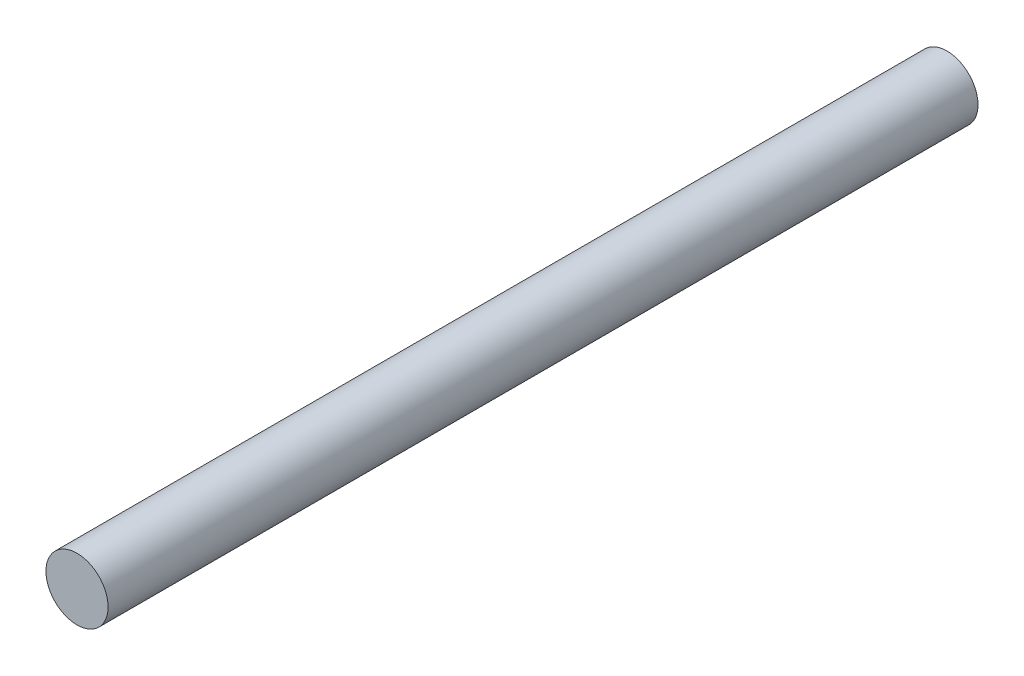
ISO-10303-21;
HEADER;
FILE_DESCRIPTION(('STEP AP214'),'2;1');
FILE_NAME('part.step','',(''),(''),'','','');
FILE_SCHEMA(('AUTOMOTIVE_DESIGN { 1 0 10303 214 1 1 1 1 }'));
ENDSEC;
DATA;
#1=APPLICATION_CONTEXT('core data for automotive mechanical design processes');
#2=APPLICATION_PROTOCOL_DEFINITION('international standard','automotive_design',2000,#1);
#3=PRODUCT_CONTEXT('',#1,'mechanical');
#4=PRODUCT('Part','Part','',(#3));
#5=PRODUCT_RELATED_PRODUCT_CATEGORY('part','',(#4));
#6=PRODUCT_DEFINITION_FORMATION('','',#4);
#7=PRODUCT_DEFINITION_CONTEXT('part definition',#1,'design');
#8=PRODUCT_DEFINITION('design','',#6,#7);
#9=PRODUCT_DEFINITION_SHAPE('','',#8);
#10=(LENGTH_UNIT() NAMED_UNIT(*) SI_UNIT(.MILLI.,.METRE.));
#11=(NAMED_UNIT(*) PLANE_ANGLE_UNIT() SI_UNIT($,.RADIAN.));
#12=(NAMED_UNIT(*) SI_UNIT($,.STERADIAN.) SOLID_ANGLE_UNIT());
#13=UNCERTAINTY_MEASURE_WITH_UNIT(LENGTH_MEASURE(1.E-05),#10,'distance_accuracy_value','');
#14=(GEOMETRIC_REPRESENTATION_CONTEXT(3) GLOBAL_UNCERTAINTY_ASSIGNED_CONTEXT((#13)) GLOBAL_UNIT_ASSIGNED_CONTEXT((#10,
#11,#12)) REPRESENTATION_CONTEXT('',''));
#15=CARTESIAN_POINT('',(0.,0.,0.));
#16=DIRECTION('',(0.,0.,1.));
#17=DIRECTION('',(1.,0.,0.));
#18=AXIS2_PLACEMENT_3D('',#15,#16,#17);
#19=CARTESIAN_POINT('',(0.,0.,70.));
#20=DIRECTION('',(0.,0.,-1.));
#21=DIRECTION('',(-1.,0.,0.));
#22=AXIS2_PLACEMENT_3D('',#19,#20,#21);
#23=CYLINDRICAL_SURFACE('',#22,2.5);
#24=CARTESIAN_POINT('',(0.,0.,70.));
#25=DIRECTION('',(0.,0.,1.));
#26=DIRECTION('',(1.,0.,0.));
#27=AXIS2_PLACEMENT_3D('',#24,#25,#26);
#28=CIRCLE('',#27,2.5);
#29=CARTESIAN_POINT('',(2.5,0.,70.));
#30=VERTEX_POINT('',#29);
#31=EDGE_CURVE('E10',#30,#30,#28,.T.);
#32=ORIENTED_EDGE('',*,*,#31,.F.);
#33=EDGE_LOOP('',(#32));
#34=FACE_BOUND('',#33,.T.);
#35=CARTESIAN_POINT('',(0.,0.,0.));
#36=DIRECTION('',(0.,0.,1.));
#37=DIRECTION('',(1.,0.,0.));
#38=AXIS2_PLACEMENT_3D('',#35,#36,#37);
#39=CIRCLE('',#38,2.5);
#40=CARTESIAN_POINT('',(2.5,0.,0.));
#41=VERTEX_POINT('',#40);
#42=EDGE_CURVE('E40',#41,#41,#39,.T.);
#43=ORIENTED_EDGE('',*,*,#42,.T.);
#44=EDGE_LOOP('',(#43));
#45=FACE_BOUND('',#44,.T.);
#46=ADVANCED_FACE('F37',(#34,#45),#23,.T.);
#47=CARTESIAN_POINT('',(0.,0.,70.));
#48=DIRECTION('',(0.,0.,1.));
#49=DIRECTION('',(1.,0.,0.));
#50=AXIS2_PLACEMENT_3D('',#47,#48,#49);
#51=PLANE('',#50);
#52=ORIENTED_EDGE('',*,*,#31,.T.);
#53=EDGE_LOOP('',(#52));
#54=FACE_BOUND('',#53,.T.);
#55=ADVANCED_FACE('F54',(#54),#51,.T.);
#56=CARTESIAN_POINT('',(0.,0.,0.));
#57=DIRECTION('',(0.,0.,1.));
#58=DIRECTION('',(1.,0.,0.));
#59=AXIS2_PLACEMENT_3D('',#56,#57,#58);
#60=PLANE('',#59);
#61=ORIENTED_EDGE('',*,*,#42,.F.);
#62=EDGE_LOOP('',(#61));
#63=FACE_BOUND('',#62,.T.);
#64=ADVANCED_FACE('F52',(#63),#60,.F.);
#65=CLOSED_SHELL('',(#46,#55,#64));
#66=MANIFOLD_SOLID_BREP('B2',#65);
#67=ADVANCED_BREP_SHAPE_REPRESENTATION('',(#18,#66),#14);
#68=SHAPE_DEFINITION_REPRESENTATION(#9,#67);
ENDSEC;
END-ISO-10303-21;
